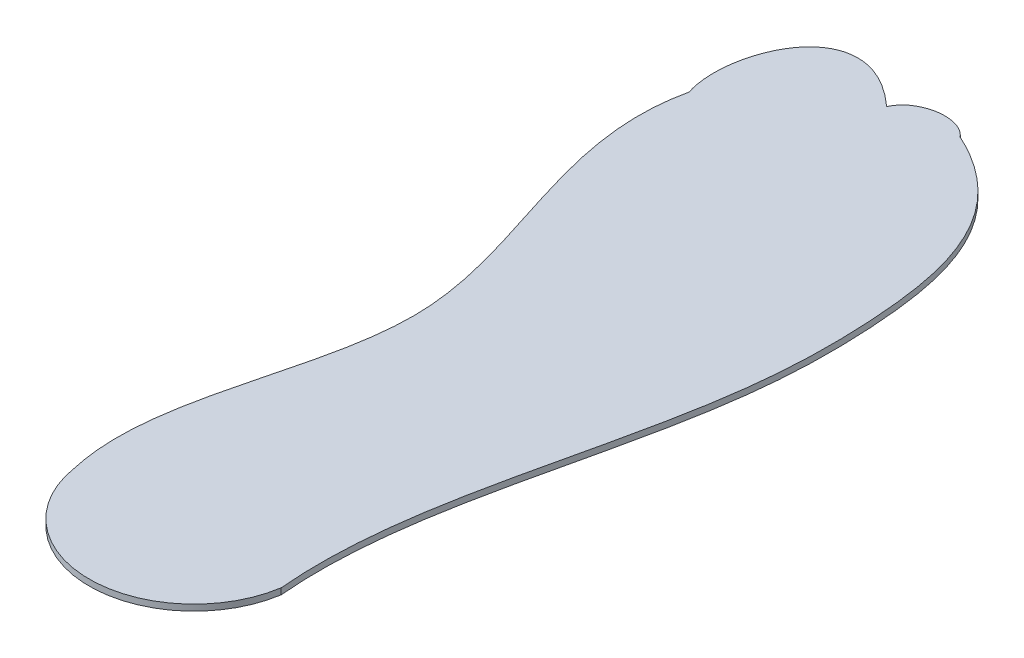
ISO-10303-21;
HEADER;
FILE_DESCRIPTION(('STEP AP214'),'2;1');
FILE_NAME('part.step','',(''),(''),'','','');
FILE_SCHEMA(('AUTOMOTIVE_DESIGN { 1 0 10303 214 1 1 1 1 }'));
ENDSEC;
DATA;
#1=APPLICATION_CONTEXT('core data for automotive mechanical design processes');
#2=APPLICATION_PROTOCOL_DEFINITION('international standard','automotive_design',2000,#1);
#3=PRODUCT_CONTEXT('',#1,'mechanical');
#4=PRODUCT('Part','Part','',(#3));
#5=PRODUCT_RELATED_PRODUCT_CATEGORY('part','',(#4));
#6=PRODUCT_DEFINITION_FORMATION('','',#4);
#7=PRODUCT_DEFINITION_CONTEXT('part definition',#1,'design');
#8=PRODUCT_DEFINITION('design','',#6,#7);
#9=PRODUCT_DEFINITION_SHAPE('','',#8);
#10=(LENGTH_UNIT() NAMED_UNIT(*) SI_UNIT(.MILLI.,.METRE.));
#11=(NAMED_UNIT(*) PLANE_ANGLE_UNIT() SI_UNIT($,.RADIAN.));
#12=(NAMED_UNIT(*) SI_UNIT($,.STERADIAN.) SOLID_ANGLE_UNIT());
#13=UNCERTAINTY_MEASURE_WITH_UNIT(LENGTH_MEASURE(1.E-05),#10,'distance_accuracy_value','');
#14=(GEOMETRIC_REPRESENTATION_CONTEXT(3) GLOBAL_UNCERTAINTY_ASSIGNED_CONTEXT((#13)) GLOBAL_UNIT_ASSIGNED_CONTEXT((#10,
#11,#12)) REPRESENTATION_CONTEXT('',''));
#15=CARTESIAN_POINT('',(0.,0.,0.));
#16=DIRECTION('',(0.,0.,1.));
#17=DIRECTION('',(1.,0.,0.));
#18=AXIS2_PLACEMENT_3D('',#15,#16,#17);
#19=CARTESIAN_POINT('',(-46.6792443169692,2.,-103.587421061923));
#20=CARTESIAN_POINT('',(-54.7970343078784,2.,-67.4699170150073));
#21=CARTESIAN_POINT('',(-5.31250584014061,2.,0.275920011871661));
#22=CARTESIAN_POINT('',(-48.4246602290817,2.,69.4646248207338));
#23=CARTESIAN_POINT('',(-40.6792443530213,2.,103.221523445282));
#24=B_SPLINE_CURVE_WITH_KNOTS('',3,(#19,#20,#21,#22,#23),.UNSPECIFIED.,.F.,.F.,(4,1,4),(0.,
0.516617751653488,1.),.UNSPECIFIED.);
#25=DIRECTION('',(0.,-1.,0.));
#26=VECTOR('',#25,1.);
#27=SURFACE_OF_LINEAR_EXTRUSION('',#24,#26);
#28=CARTESIAN_POINT('',(-46.6792443169692,0.,-103.587421061923));
#29=CARTESIAN_POINT('',(-54.7970343078784,0.,-67.4699170150073));
#30=CARTESIAN_POINT('',(-5.31250584014061,0.,0.275920011871661));
#31=CARTESIAN_POINT('',(-48.4246602290817,0.,69.4646248207338));
#32=CARTESIAN_POINT('',(-40.6792443530213,0.,103.221523445282));
#33=B_SPLINE_CURVE_WITH_KNOTS('',3,(#28,#29,#30,#31,#32),.UNSPECIFIED.,.F.,.F.,(4,1,4),(0.,
0.516617751653488,1.),.UNSPECIFIED.);
#34=CARTESIAN_POINT('',(-46.6792443169692,0.,-103.587421061923));
#35=VERTEX_POINT('',#34);
#36=CARTESIAN_POINT('',(-40.6792443530213,0.,103.221523445283));
#37=VERTEX_POINT('',#36);
#38=EDGE_CURVE('E152',#35,#37,#33,.T.);
#39=ORIENTED_EDGE('',*,*,#38,.T.);
#40=DIRECTION('',(0.,-1.,0.));
#41=VECTOR('',#40,1.);
#42=CARTESIAN_POINT('',(-40.6792443530213,2.,103.221523445283));
#43=LINE('',#42,#41);
#44=CARTESIAN_POINT('',(-40.6792443530213,2.,103.221523445283));
#45=VERTEX_POINT('',#44);
#46=EDGE_CURVE('E11',#45,#37,#43,.T.);
#47=ORIENTED_EDGE('',*,*,#46,.F.);
#48=CARTESIAN_POINT('',(-46.6792443169692,2.,-103.587421061923));
#49=VERTEX_POINT('',#48);
#50=EDGE_CURVE('E175',#49,#45,#24,.T.);
#51=ORIENTED_EDGE('',*,*,#50,.F.);
#52=DIRECTION('',(0.,-1.,0.));
#53=VECTOR('',#52,1.);
#54=CARTESIAN_POINT('',(-46.6792443169692,2.,-103.587421061923));
#55=LINE('',#54,#53);
#56=EDGE_CURVE('E117',#49,#35,#55,.T.);
#57=ORIENTED_EDGE('',*,*,#56,.T.);
#58=EDGE_LOOP('',(#39,#47,#51,#57));
#59=FACE_BOUND('',#58,.T.);
#60=ADVANCED_FACE('F41',(#59),#27,.F.);
#61=CARTESIAN_POINT('',(-6.88458352549837,2.,97.9138093528184));
#62=DIRECTION('',(0.,-1.,0.));
#63=DIRECTION('',(0.,0.,-1.));
#64=AXIS2_PLACEMENT_3D('',#61,#62,#63);
#65=CYLINDRICAL_SURFACE('',#64,34.2089305494144);
#66=CARTESIAN_POINT('',(-6.88458352549837,0.,97.9138093528184));
#67=DIRECTION('',(0.,1.,0.));
#68=DIRECTION('',(0.,0.,1.));
#69=AXIS2_PLACEMENT_3D('',#66,#67,#68);
#70=CIRCLE('',#69,34.2089305494144);
#71=CARTESIAN_POINT('',(26.9100773546016,0.,103.22152311052));
#72=VERTEX_POINT('',#71);
#73=EDGE_CURVE('E146',#37,#72,#70,.T.);
#74=ORIENTED_EDGE('',*,*,#73,.T.);
#75=DIRECTION('',(0.,-1.,0.));
#76=VECTOR('',#75,1.);
#77=CARTESIAN_POINT('',(26.9100773546016,2.,103.22152311052));
#78=LINE('',#77,#76);
#79=CARTESIAN_POINT('',(26.9100773546016,2.,103.22152311052));
#80=VERTEX_POINT('',#79);
#81=EDGE_CURVE('E51',#80,#72,#78,.T.);
#82=ORIENTED_EDGE('',*,*,#81,.F.);
#83=CARTESIAN_POINT('',(-6.88458352549837,2.,97.9138093528184));
#84=DIRECTION('',(0.,1.,0.));
#85=DIRECTION('',(0.,0.,1.));
#86=AXIS2_PLACEMENT_3D('',#83,#84,#85);
#87=CIRCLE('',#86,34.2089305494144);
#88=EDGE_CURVE('E93',#45,#80,#87,.T.);
#89=ORIENTED_EDGE('',*,*,#88,.F.);
#90=ORIENTED_EDGE('',*,*,#46,.T.);
#91=EDGE_LOOP('',(#74,#82,#89,#90));
#92=FACE_BOUND('',#91,.T.);
#93=ADVANCED_FACE('F140',(#92),#65,.T.);
#94=CARTESIAN_POINT('',(26.9100773546016,2.,103.22152311052));
#95=CARTESIAN_POINT('',(22.5703205990594,2.,55.2447015868269));
#96=CARTESIAN_POINT('',(48.3635822445777,2.,-1.74367319640638));
#97=CARTESIAN_POINT('',(48.0957925812097,2.,-85.9317851606853));
#98=CARTESIAN_POINT('',(39.4025552077686,2.,-121.787875106749));
#99=CARTESIAN_POINT('',(10.320756150345,2.,-135.087420221293));
#100=B_SPLINE_CURVE_WITH_KNOTS('',3,(#94,#95,#96,#97,#98,#99),.UNSPECIFIED.,.F.,.F.,(4,1,1,4),
(0.,0.570455855909871,0.703178874056801,1.),.UNSPECIFIED.);
#101=DIRECTION('',(0.,-1.,0.));
#102=VECTOR('',#101,1.);
#103=SURFACE_OF_LINEAR_EXTRUSION('',#100,#102);
#104=CARTESIAN_POINT('',(26.9100773546016,0.,103.22152311052));
#105=CARTESIAN_POINT('',(22.5703205990594,0.,55.2447015868269));
#106=CARTESIAN_POINT('',(48.3635822445777,0.,-1.74367319640638));
#107=CARTESIAN_POINT('',(48.0957925812097,0.,-85.9317851606853));
#108=CARTESIAN_POINT('',(39.4025552077686,0.,-121.787875106749));
#109=CARTESIAN_POINT('',(10.320756150345,0.,-135.087420221293));
#110=B_SPLINE_CURVE_WITH_KNOTS('',3,(#104,#105,#106,#107,#108,#109),.UNSPECIFIED.,.F.,.F.,(4,1,
1,4),(0.,0.570455855909871,0.703178874056801,1.),.UNSPECIFIED.);
#111=CARTESIAN_POINT('',(10.320756150345,0.,-135.087420221293));
#112=VERTEX_POINT('',#111);
#113=EDGE_CURVE('E109',#72,#112,#110,.T.);
#114=ORIENTED_EDGE('',*,*,#113,.T.);
#115=DIRECTION('',(0.,-1.,0.));
#116=VECTOR('',#115,1.);
#117=CARTESIAN_POINT('',(10.320756150345,2.,-135.087420221293));
#118=LINE('',#117,#116);
#119=CARTESIAN_POINT('',(10.320756150345,2.,-135.087420221293));
#120=VERTEX_POINT('',#119);
#121=EDGE_CURVE('E106',#120,#112,#118,.T.);
#122=ORIENTED_EDGE('',*,*,#121,.F.);
#123=EDGE_CURVE('E97',#80,#120,#100,.T.);
#124=ORIENTED_EDGE('',*,*,#123,.F.);
#125=ORIENTED_EDGE('',*,*,#81,.T.);
#126=EDGE_LOOP('',(#114,#122,#124,#125));
#127=FACE_BOUND('',#126,.T.);
#128=ADVANCED_FACE('F107',(#127),#103,.F.);
#129=CARTESIAN_POINT('',(10.320756150345,2.,-135.087420221293));
#130=CARTESIAN_POINT('',(5.2804504453494,2.,-141.193491304834));
#131=CARTESIAN_POINT('',(-7.25265035609217,2.,-138.974935500836));
#132=CARTESIAN_POINT('',(-10.2961983925462,2.,-131.704373687516));
#133=B_SPLINE_CURVE_WITH_KNOTS('',3,(#129,#130,#131,#132),.UNSPECIFIED.,.F.,.F.,(4,4),(0.,1.),.UNSPECIFIED.);
#134=DIRECTION('',(0.,-1.,0.));
#135=VECTOR('',#134,1.);
#136=SURFACE_OF_LINEAR_EXTRUSION('',#133,#135);
#137=CARTESIAN_POINT('',(10.320756150345,0.,-135.087420221293));
#138=CARTESIAN_POINT('',(5.2804504453494,0.,-141.193491304834));
#139=CARTESIAN_POINT('',(-7.25265035609217,0.,-138.974935500836));
#140=CARTESIAN_POINT('',(-10.2961983925462,0.,-131.704373687516));
#141=B_SPLINE_CURVE_WITH_KNOTS('',3,(#137,#138,#139,#140),.UNSPECIFIED.,.F.,.F.,(4,4),(0.,1.),.UNSPECIFIED.);
#142=CARTESIAN_POINT('',(-10.2961983925462,0.,-131.704373687516));
#143=VERTEX_POINT('',#142);
#144=EDGE_CURVE('E79',#112,#143,#141,.T.);
#145=ORIENTED_EDGE('',*,*,#144,.T.);
#146=DIRECTION('',(0.,-1.,0.));
#147=VECTOR('',#146,1.);
#148=CARTESIAN_POINT('',(-10.2961983925462,2.,-131.704373687516));
#149=LINE('',#148,#147);
#150=CARTESIAN_POINT('',(-10.2961983925462,2.,-131.704373687516));
#151=VERTEX_POINT('',#150);
#152=EDGE_CURVE('E111',#151,#143,#149,.T.);
#153=ORIENTED_EDGE('',*,*,#152,.F.);
#154=EDGE_CURVE('E101',#120,#151,#133,.T.);
#155=ORIENTED_EDGE('',*,*,#154,.F.);
#156=ORIENTED_EDGE('',*,*,#121,.T.);
#157=EDGE_LOOP('',(#145,#153,#155,#156));
#158=FACE_BOUND('',#157,.T.);
#159=ADVANCED_FACE('F113',(#158),#136,.F.);
#160=CARTESIAN_POINT('',(-10.2961983925462,2.,-131.704373687516));
#161=CARTESIAN_POINT('',(-38.6369555814792,2.,-157.574381944119));
#162=CARTESIAN_POINT('',(-52.7857609866805,2.,-121.907427010523));
#163=CARTESIAN_POINT('',(-46.6792443169692,2.,-103.587421061923));
#164=B_SPLINE_CURVE_WITH_KNOTS('',3,(#160,#161,#162,#163),.UNSPECIFIED.,.F.,.F.,(4,4),(0.,1.),.UNSPECIFIED.);
#165=DIRECTION('',(0.,-1.,0.));
#166=VECTOR('',#165,1.);
#167=SURFACE_OF_LINEAR_EXTRUSION('',#164,#166);
#168=CARTESIAN_POINT('',(-10.2961983925462,0.,-131.704373687516));
#169=CARTESIAN_POINT('',(-38.6369555814792,0.,-157.574381944119));
#170=CARTESIAN_POINT('',(-52.7857609866805,0.,-121.907427010523));
#171=CARTESIAN_POINT('',(-46.6792443169692,0.,-103.587421061923));
#172=B_SPLINE_CURVE_WITH_KNOTS('',3,(#168,#169,#170,#171),.UNSPECIFIED.,.F.,.F.,(4,4),(0.,1.),.UNSPECIFIED.);
#173=EDGE_CURVE('E85',#143,#35,#172,.T.);
#174=ORIENTED_EDGE('',*,*,#173,.T.);
#175=ORIENTED_EDGE('',*,*,#56,.F.);
#176=EDGE_CURVE('E59',#151,#49,#164,.T.);
#177=ORIENTED_EDGE('',*,*,#176,.F.);
#178=ORIENTED_EDGE('',*,*,#152,.T.);
#179=EDGE_LOOP('',(#174,#175,#177,#178));
#180=FACE_BOUND('',#179,.T.);
#181=ADVANCED_FACE('F137',(#180),#167,.F.);
#182=CARTESIAN_POINT('',(-28.5382508341416,2.,-0.500786752228683));
#183=DIRECTION('',(0.,1.,0.));
#184=DIRECTION('',(0.,0.,1.));
#185=AXIS2_PLACEMENT_3D('',#182,#183,#184);
#186=PLANE('',#185);
#187=ORIENTED_EDGE('',*,*,#50,.T.);
#188=ORIENTED_EDGE('',*,*,#88,.T.);
#189=ORIENTED_EDGE('',*,*,#123,.T.);
#190=ORIENTED_EDGE('',*,*,#154,.T.);
#191=ORIENTED_EDGE('',*,*,#176,.T.);
#192=EDGE_LOOP('',(#187,#188,#189,#190,#191));
#193=FACE_BOUND('',#192,.T.);
#194=ADVANCED_FACE('F99',(#193),#186,.T.);
#195=CARTESIAN_POINT('',(-28.5382508341416,0.,-0.500786752228683));
#196=DIRECTION('',(0.,1.,0.));
#197=DIRECTION('',(0.,0.,1.));
#198=AXIS2_PLACEMENT_3D('',#195,#196,#197);
#199=PLANE('',#198);
#200=ORIENTED_EDGE('',*,*,#38,.F.);
#201=ORIENTED_EDGE('',*,*,#173,.F.);
#202=ORIENTED_EDGE('',*,*,#144,.F.);
#203=ORIENTED_EDGE('',*,*,#113,.F.);
#204=ORIENTED_EDGE('',*,*,#73,.F.);
#205=EDGE_LOOP('',(#200,#201,#202,#203,#204));
#206=FACE_BOUND('',#205,.T.);
#207=ADVANCED_FACE('F155',(#206),#199,.F.);
#208=CLOSED_SHELL('',(#60,#93,#128,#159,#181,#194,#207));
#209=MANIFOLD_SOLID_BREP('B2',#208);
#210=ADVANCED_BREP_SHAPE_REPRESENTATION('',(#18,#209),#14);
#211=SHAPE_DEFINITION_REPRESENTATION(#9,#210);
ENDSEC;
END-ISO-10303-21;
